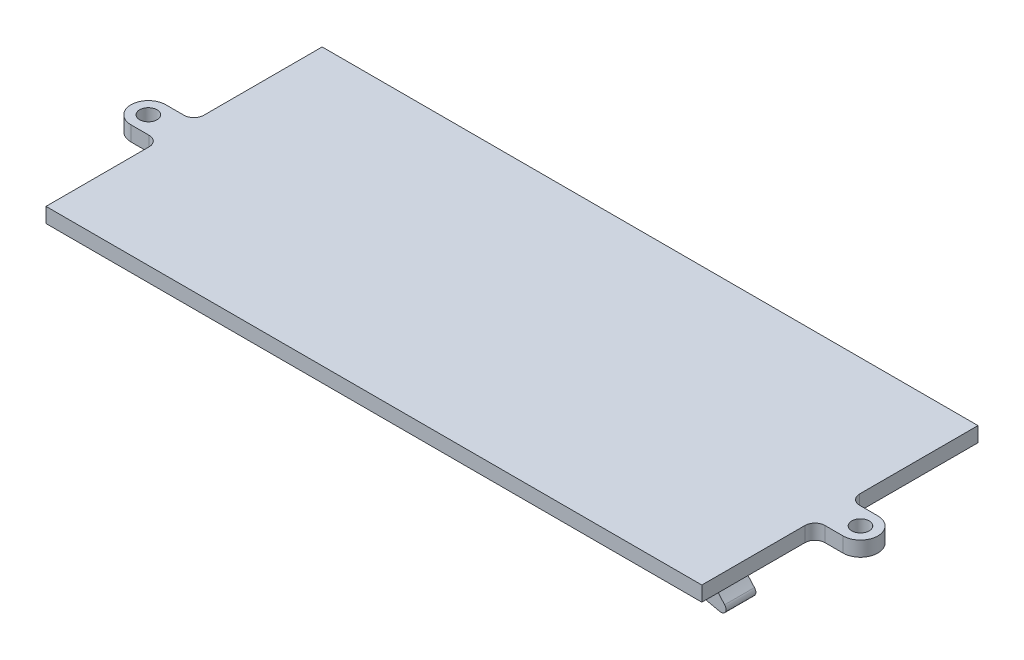
ISO-10303-21;
HEADER;
FILE_DESCRIPTION(('STEP AP214'),'2;1');
FILE_NAME('part.step','',(''),(''),'','','');
FILE_SCHEMA(('AUTOMOTIVE_DESIGN { 1 0 10303 214 1 1 1 1 }'));
ENDSEC;
DATA;
#1=APPLICATION_CONTEXT('core data for automotive mechanical design processes');
#2=APPLICATION_PROTOCOL_DEFINITION('international standard','automotive_design',2000,#1);
#3=PRODUCT_CONTEXT('',#1,'mechanical');
#4=PRODUCT('Part','Part','',(#3));
#5=PRODUCT_RELATED_PRODUCT_CATEGORY('part','',(#4));
#6=PRODUCT_DEFINITION_FORMATION('','',#4);
#7=PRODUCT_DEFINITION_CONTEXT('part definition',#1,'design');
#8=PRODUCT_DEFINITION('design','',#6,#7);
#9=PRODUCT_DEFINITION_SHAPE('','',#8);
#10=(LENGTH_UNIT() NAMED_UNIT(*) SI_UNIT(.MILLI.,.METRE.));
#11=(NAMED_UNIT(*) PLANE_ANGLE_UNIT() SI_UNIT($,.RADIAN.));
#12=(NAMED_UNIT(*) SI_UNIT($,.STERADIAN.) SOLID_ANGLE_UNIT());
#13=UNCERTAINTY_MEASURE_WITH_UNIT(LENGTH_MEASURE(1.E-05),#10,'distance_accuracy_value','');
#14=(GEOMETRIC_REPRESENTATION_CONTEXT(3) GLOBAL_UNCERTAINTY_ASSIGNED_CONTEXT((#13)) GLOBAL_UNIT_ASSIGNED_CONTEXT((#10,
#11,#12)) REPRESENTATION_CONTEXT('',''));
#15=CARTESIAN_POINT('',(0.,0.,0.));
#16=DIRECTION('',(0.,0.,1.));
#17=DIRECTION('',(1.,0.,0.));
#18=AXIS2_PLACEMENT_3D('',#15,#16,#17);
#19=CARTESIAN_POINT('',(0.,-74.,0.));
#20=DIRECTION('',(0.,-1.,0.));
#21=DIRECTION('',(1.,0.,0.));
#22=AXIS2_PLACEMENT_3D('',#19,#20,#21);
#23=PLANE('',#22);
#24=DIRECTION('',(1.,0.,0.));
#25=VECTOR('',#24,1.);
#26=CARTESIAN_POINT('',(-39.1631946524163,-74.,-27.5824678281042));
#27=LINE('',#26,#25);
#28=CARTESIAN_POINT('',(-39.1631946524163,-74.,-27.5824678281042));
#29=VERTEX_POINT('',#28);
#30=CARTESIAN_POINT('',(-20.86563649514,-74.,-27.5824678281042));
#31=VERTEX_POINT('',#30);
#32=EDGE_CURVE('E297',#29,#31,#27,.T.);
#33=ORIENTED_EDGE('',*,*,#32,.T.);
#34=DIRECTION('',(0.,0.,-1.));
#35=VECTOR('',#34,1.);
#36=CARTESIAN_POINT('',(-20.86563649514,-74.,-27.5824678281042));
#37=LINE('',#36,#35);
#38=CARTESIAN_POINT('',(-20.86563649514,-74.,-33.5824678281042));
#39=VERTEX_POINT('',#38);
#40=EDGE_CURVE('E302',#31,#39,#37,.T.);
#41=ORIENTED_EDGE('',*,*,#40,.T.);
#42=DIRECTION('',(1.,0.,0.));
#43=VECTOR('',#42,1.);
#44=CARTESIAN_POINT('',(-39.1631946524163,-74.,-33.5824678281042));
#45=LINE('',#44,#43);
#46=CARTESIAN_POINT('',(-39.1631946524163,-74.,-33.5824678281042));
#47=VERTEX_POINT('',#46);
#48=EDGE_CURVE('E287',#47,#39,#45,.T.);
#49=ORIENTED_EDGE('',*,*,#48,.F.);
#50=DIRECTION('',(0.,0.,-1.));
#51=VECTOR('',#50,1.);
#52=CARTESIAN_POINT('',(-39.1631946524163,-74.,-27.5824678281042));
#53=LINE('',#52,#51);
#54=EDGE_CURVE('E301',#29,#47,#53,.T.);
#55=ORIENTED_EDGE('',*,*,#54,.F.);
#56=EDGE_LOOP('',(#33,#41,#49,#55));
#57=FACE_BOUND('',#56,.T.);
#58=DIRECTION('',(0.,0.,-1.));
#59=VECTOR('',#58,1.);
#60=CARTESIAN_POINT('',(-65.9999999999999,-74.,-4.99999999999999));
#61=LINE('',#60,#59);
#62=CARTESIAN_POINT('',(-65.9999999999999,-74.,-4.99999999999999));
#63=VERTEX_POINT('',#62);
#64=CARTESIAN_POINT('',(-65.9999999999999,-74.,-25.7671955427555));
#65=VERTEX_POINT('',#64);
#66=EDGE_CURVE('E440',#63,#65,#61,.T.);
#67=ORIENTED_EDGE('',*,*,#66,.T.);
#68=CARTESIAN_POINT('',(-68.,-74.,-25.7671955427555));
#69=DIRECTION('',(0.,-1.,0.));
#70=DIRECTION('',(1.,0.,0.));
#71=AXIS2_PLACEMENT_3D('',#68,#69,#70);
#72=CIRCLE('',#71,2.);
#73=CARTESIAN_POINT('',(-68.,-74.,-27.7671955427555));
#74=VERTEX_POINT('',#73);
#75=EDGE_CURVE('E357',#74,#65,#72,.T.);
#76=ORIENTED_EDGE('',*,*,#75,.F.);
#77=DIRECTION('',(-1.,0.,0.));
#78=VECTOR('',#77,1.);
#79=CARTESIAN_POINT('',(-1.65634172628686E-13,-74.,-27.7671955427558));
#80=LINE('',#79,#78);
#81=CARTESIAN_POINT('',(-71.6621267420827,-74.,-27.7671955427554));
#82=VERTEX_POINT('',#81);
#83=EDGE_CURVE('E402',#74,#82,#80,.T.);
#84=ORIENTED_EDGE('',*,*,#83,.T.);
#85=CARTESIAN_POINT('',(-71.6621267420827,-74.,-31.2671955427555));
#86=DIRECTION('',(0.,-1.,0.));
#87=DIRECTION('',(1.,0.,0.));
#88=AXIS2_PLACEMENT_3D('',#85,#86,#87);
#89=CIRCLE('',#88,3.50000000000001);
#90=CARTESIAN_POINT('',(-71.6621267420827,-74.,-34.7671955427555));
#91=VERTEX_POINT('',#90);
#92=EDGE_CURVE('E406',#82,#91,#89,.T.);
#93=ORIENTED_EDGE('',*,*,#92,.T.);
#94=DIRECTION('',(1.,0.,0.));
#95=VECTOR('',#94,1.);
#96=CARTESIAN_POINT('',(0.,-74.,-34.7671955427556));
#97=LINE('',#96,#95);
#98=CARTESIAN_POINT('',(-68.0000000000001,-74.,-34.7671955427555));
#99=VERTEX_POINT('',#98);
#100=EDGE_CURVE('E410',#91,#99,#97,.T.);
#101=ORIENTED_EDGE('',*,*,#100,.T.);
#102=CARTESIAN_POINT('',(-68.,-74.,-36.7671955427555));
#103=DIRECTION('',(0.,-1.,0.));
#104=DIRECTION('',(1.,0.,0.));
#105=AXIS2_PLACEMENT_3D('',#102,#103,#104);
#106=CIRCLE('',#105,2.00000000000001);
#107=CARTESIAN_POINT('',(-65.9999999999999,-74.,-36.7671955427555));
#108=VERTEX_POINT('',#107);
#109=EDGE_CURVE('E414',#108,#99,#106,.T.);
#110=ORIENTED_EDGE('',*,*,#109,.F.);
#111=CARTESIAN_POINT('',(-65.9999999999999,-74.,-60.5824678281042));
#112=VERTEX_POINT('',#111);
#113=EDGE_CURVE('E445',#108,#112,#61,.T.);
#114=ORIENTED_EDGE('',*,*,#113,.T.);
#115=DIRECTION('',(1.,0.,0.));
#116=VECTOR('',#115,1.);
#117=CARTESIAN_POINT('',(-65.9999999999999,-74.,-60.5824678281042));
#118=LINE('',#117,#116);
#119=CARTESIAN_POINT('',(66.,-74.0000000000001,-60.5824678281042));
#120=VERTEX_POINT('',#119);
#121=EDGE_CURVE('E444',#112,#120,#118,.T.);
#122=ORIENTED_EDGE('',*,*,#121,.T.);
#123=DIRECTION('',(0.,0.,1.));
#124=VECTOR('',#123,1.);
#125=CARTESIAN_POINT('',(66.,-74.0000000000001,-4.99999999999999));
#126=LINE('',#125,#124);
#127=CARTESIAN_POINT('',(66.,-74.0000000000001,-36.7671955427554));
#128=VERTEX_POINT('',#127);
#129=EDGE_CURVE('E449',#120,#128,#126,.T.);
#130=ORIENTED_EDGE('',*,*,#129,.T.);
#131=CARTESIAN_POINT('',(68.0000000000002,-74.0000000000001,-36.7671955427554));
#132=DIRECTION('',(0.,-1.,0.));
#133=DIRECTION('',(1.,0.,0.));
#134=AXIS2_PLACEMENT_3D('',#131,#132,#133);
#135=CIRCLE('',#134,2.00000000000001);
#136=CARTESIAN_POINT('',(68.0000000000002,-74.0000000000001,-34.7671955427554));
#137=VERTEX_POINT('',#136);
#138=EDGE_CURVE('E336',#128,#137,#135,.F.);
#139=ORIENTED_EDGE('',*,*,#138,.T.);
#140=DIRECTION('',(-1.,0.,0.));
#141=VECTOR('',#140,1.);
#142=CARTESIAN_POINT('',(0.,-74.,-34.7671955427556));
#143=LINE('',#142,#141);
#144=CARTESIAN_POINT('',(71.6621267420828,-74.0000000000001,-34.7671955427554));
#145=VERTEX_POINT('',#144);
#146=EDGE_CURVE('E340',#145,#137,#143,.T.);
#147=ORIENTED_EDGE('',*,*,#146,.F.);
#148=CARTESIAN_POINT('',(71.6621267420827,-74.0000000000001,-31.2671955427554));
#149=DIRECTION('',(0.,-1.,0.));
#150=DIRECTION('',(1.,0.,0.));
#151=AXIS2_PLACEMENT_3D('',#148,#149,#150);
#152=CIRCLE('',#151,3.50000000000001);
#153=CARTESIAN_POINT('',(71.6621267420827,-74.0000000000001,-27.7671955427554));
#154=VERTEX_POINT('',#153);
#155=EDGE_CURVE('E344',#154,#145,#152,.F.);
#156=ORIENTED_EDGE('',*,*,#155,.F.);
#157=DIRECTION('',(1.,0.,0.));
#158=VECTOR('',#157,1.);
#159=CARTESIAN_POINT('',(0.,-74.,-27.7671955427557));
#160=LINE('',#159,#158);
#161=CARTESIAN_POINT('',(68.0000000000001,-74.0000000000001,-27.7671955427554));
#162=VERTEX_POINT('',#161);
#163=EDGE_CURVE('E347',#162,#154,#160,.T.);
#164=ORIENTED_EDGE('',*,*,#163,.F.);
#165=CARTESIAN_POINT('',(68.0000000000001,-74.0000000000001,-25.7671955427554));
#166=DIRECTION('',(0.,-1.,0.));
#167=DIRECTION('',(1.,0.,0.));
#168=AXIS2_PLACEMENT_3D('',#165,#166,#167);
#169=CIRCLE('',#168,2.);
#170=CARTESIAN_POINT('',(66.,-74.0000000000001,-25.7671955427554));
#171=VERTEX_POINT('',#170);
#172=EDGE_CURVE('E315',#162,#171,#169,.F.);
#173=ORIENTED_EDGE('',*,*,#172,.T.);
#174=CARTESIAN_POINT('',(66.,-74.0000000000001,-4.99999999999999));
#175=VERTEX_POINT('',#174);
#176=EDGE_CURVE('E448',#171,#175,#126,.T.);
#177=ORIENTED_EDGE('',*,*,#176,.T.);
#178=DIRECTION('',(-1.,0.,0.));
#179=VECTOR('',#178,1.);
#180=CARTESIAN_POINT('',(-65.9999999999999,-74.,-4.99999999999999));
#181=LINE('',#180,#179);
#182=EDGE_CURVE('E453',#175,#63,#181,.T.);
#183=ORIENTED_EDGE('',*,*,#182,.T.);
#184=EDGE_LOOP('',(#67,#76,#84,#93,#101,#110,#114,#122,#130,#139,#147,#156,#164,#173,#177,#183));
#185=FACE_BOUND('',#184,.T.);
#186=CARTESIAN_POINT('',(-71.6621267420827,-74.,-31.2671955427555));
#187=DIRECTION('',(0.,-1.,0.));
#188=DIRECTION('',(1.,0.,0.));
#189=AXIS2_PLACEMENT_3D('',#186,#187,#188);
#190=CIRCLE('',#189,1.75);
#191=CARTESIAN_POINT('',(-69.9121267420827,-74.,-31.2671955427555));
#192=VERTEX_POINT('',#191);
#193=EDGE_CURVE('E379',#192,#192,#190,.T.);
#194=ORIENTED_EDGE('',*,*,#193,.F.);
#195=EDGE_LOOP('',(#194));
#196=FACE_BOUND('',#195,.T.);
#197=CARTESIAN_POINT('',(71.6621267420827,-74.0000000000001,-31.2671955427554));
#198=DIRECTION('',(0.,-1.,0.));
#199=DIRECTION('',(1.,0.,0.));
#200=AXIS2_PLACEMENT_3D('',#197,#198,#199);
#201=CIRCLE('',#200,1.75);
#202=CARTESIAN_POINT('',(73.4121267420827,-74.0000000000001,-31.2671955427554));
#203=VERTEX_POINT('',#202);
#204=EDGE_CURVE('E306',#203,#203,#201,.F.);
#205=ORIENTED_EDGE('',*,*,#204,.T.);
#206=EDGE_LOOP('',(#205));
#207=FACE_BOUND('',#206,.T.);
#208=DIRECTION('',(0.,0.,-1.));
#209=VECTOR('',#208,1.);
#210=CARTESIAN_POINT('',(20.8656364951401,-74.0000000000001,-27.5824678281042));
#211=LINE('',#210,#209);
#212=CARTESIAN_POINT('',(20.8656364951401,-74.,-27.5824678281042));
#213=VERTEX_POINT('',#212);
#214=CARTESIAN_POINT('',(20.8656364951401,-74.,-33.5824678281042));
#215=VERTEX_POINT('',#214);
#216=EDGE_CURVE('E253',#213,#215,#211,.T.);
#217=ORIENTED_EDGE('',*,*,#216,.F.);
#218=DIRECTION('',(1.,0.,0.));
#219=VECTOR('',#218,1.);
#220=CARTESIAN_POINT('',(39.1631946524164,-74.0000000000002,-27.5824678281042));
#221=LINE('',#220,#219);
#222=CARTESIAN_POINT('',(39.1631946524164,-74.,-27.5824678281042));
#223=VERTEX_POINT('',#222);
#224=EDGE_CURVE('E246',#213,#223,#221,.T.);
#225=ORIENTED_EDGE('',*,*,#224,.T.);
#226=DIRECTION('',(0.,0.,-1.));
#227=VECTOR('',#226,1.);
#228=CARTESIAN_POINT('',(39.1631946524164,-74.0000000000002,-27.5824678281042));
#229=LINE('',#228,#227);
#230=CARTESIAN_POINT('',(39.1631946524164,-74.0000000000002,-33.5824678281042));
#231=VERTEX_POINT('',#230);
#232=EDGE_CURVE('E240',#223,#231,#229,.T.);
#233=ORIENTED_EDGE('',*,*,#232,.T.);
#234=DIRECTION('',(1.,0.,0.));
#235=VECTOR('',#234,1.);
#236=CARTESIAN_POINT('',(39.1631946524164,-74.0000000000002,-33.5824678281042));
#237=LINE('',#236,#235);
#238=EDGE_CURVE('E243',#215,#231,#237,.T.);
#239=ORIENTED_EDGE('',*,*,#238,.F.);
#240=EDGE_LOOP('',(#217,#225,#233,#239));
#241=FACE_BOUND('',#240,.T.);
#242=ADVANCED_FACE('F80',(#57,#185,#196,#207,#241),#23,.T.);
#243=CARTESIAN_POINT('',(66.,-74.0000000000001,-4.99999999999999));
#244=DIRECTION('',(-1.,0.,0.));
#245=DIRECTION('',(0.,-1.,0.));
#246=AXIS2_PLACEMENT_3D('',#243,#244,#245);
#247=PLANE('',#246);
#248=DIRECTION('',(0.,-1.,0.));
#249=VECTOR('',#248,1.);
#250=CARTESIAN_POINT('',(66.,-71.,-36.7671955427554));
#251=LINE('',#250,#249);
#252=CARTESIAN_POINT('',(66.,-71.,-36.7671955427554));
#253=VERTEX_POINT('',#252);
#254=EDGE_CURVE('E332',#253,#128,#251,.T.);
#255=ORIENTED_EDGE('',*,*,#254,.T.);
#256=ORIENTED_EDGE('',*,*,#129,.F.);
#257=DIRECTION('',(0.,1.,0.));
#258=VECTOR('',#257,1.);
#259=CARTESIAN_POINT('',(66.,-74.0000000000001,-60.5824678281042));
#260=LINE('',#259,#258);
#261=CARTESIAN_POINT('',(66.,-71.,-60.5824678281042));
#262=VERTEX_POINT('',#261);
#263=EDGE_CURVE('E477',#120,#262,#260,.T.);
#264=ORIENTED_EDGE('',*,*,#263,.T.);
#265=DIRECTION('',(0.,0.,1.));
#266=VECTOR('',#265,1.);
#267=CARTESIAN_POINT('',(66.,-71.,-4.99999999999999));
#268=LINE('',#267,#266);
#269=EDGE_CURVE('E464',#262,#253,#268,.T.);
#270=ORIENTED_EDGE('',*,*,#269,.T.);
#271=EDGE_LOOP('',(#255,#256,#264,#270));
#272=FACE_BOUND('',#271,.T.);
#273=ADVANCED_FACE('F581',(#272),#247,.F.);
#274=CARTESIAN_POINT('',(-65.9999999999999,-74.,-4.99999999999999));
#275=DIRECTION('',(1.,0.,0.));
#276=DIRECTION('',(0.,1.,0.));
#277=AXIS2_PLACEMENT_3D('',#274,#275,#276);
#278=PLANE('',#277);
#279=DIRECTION('',(0.,-1.,0.));
#280=VECTOR('',#279,1.);
#281=CARTESIAN_POINT('',(-65.9999999999999,-71.,-36.7671955427555));
#282=LINE('',#281,#280);
#283=CARTESIAN_POINT('',(-65.9999999999999,-71.,-36.7671955427555));
#284=VERTEX_POINT('',#283);
#285=EDGE_CURVE('E425',#284,#108,#282,.T.);
#286=ORIENTED_EDGE('',*,*,#285,.F.);
#287=DIRECTION('',(0.,0.,-1.));
#288=VECTOR('',#287,1.);
#289=CARTESIAN_POINT('',(-65.9999999999999,-71.,-4.99999999999999));
#290=LINE('',#289,#288);
#291=CARTESIAN_POINT('',(-65.9999999999999,-71.,-60.5824678281042));
#292=VERTEX_POINT('',#291);
#293=EDGE_CURVE('E424',#284,#292,#290,.T.);
#294=ORIENTED_EDGE('',*,*,#293,.T.);
#295=DIRECTION('',(0.,1.,0.));
#296=VECTOR('',#295,1.);
#297=CARTESIAN_POINT('',(-65.9999999999999,-74.,-60.5824678281042));
#298=LINE('',#297,#296);
#299=EDGE_CURVE('E481',#112,#292,#298,.T.);
#300=ORIENTED_EDGE('',*,*,#299,.F.);
#301=ORIENTED_EDGE('',*,*,#113,.F.);
#302=EDGE_LOOP('',(#286,#294,#300,#301));
#303=FACE_BOUND('',#302,.T.);
#304=ADVANCED_FACE('F510',(#303),#278,.F.);
#305=CARTESIAN_POINT('',(-65.9999999999999,-71.,-4.99999999999999));
#306=VERTEX_POINT('',#305);
#307=CARTESIAN_POINT('',(-65.9999999999999,-71.,-25.7671955427555));
#308=VERTEX_POINT('',#307);
#309=EDGE_CURVE('E457',#306,#308,#290,.T.);
#310=ORIENTED_EDGE('',*,*,#309,.T.);
#311=DIRECTION('',(0.,-1.,0.));
#312=VECTOR('',#311,1.);
#313=CARTESIAN_POINT('',(-65.9999999999999,-71.,-25.7671955427555));
#314=LINE('',#313,#312);
#315=EDGE_CURVE('E421',#308,#65,#314,.T.);
#316=ORIENTED_EDGE('',*,*,#315,.T.);
#317=ORIENTED_EDGE('',*,*,#66,.F.);
#318=DIRECTION('',(0.,1.,0.));
#319=VECTOR('',#318,1.);
#320=CARTESIAN_POINT('',(-65.9999999999999,-74.,-4.99999999999999));
#321=LINE('',#320,#319);
#322=EDGE_CURVE('E456',#63,#306,#321,.T.);
#323=ORIENTED_EDGE('',*,*,#322,.T.);
#324=EDGE_LOOP('',(#310,#316,#317,#323));
#325=FACE_BOUND('',#324,.T.);
#326=ADVANCED_FACE('F549',(#325),#278,.F.);
#327=CARTESIAN_POINT('',(-65.9999999999999,-74.,-60.5824678281042));
#328=DIRECTION('',(0.,0.,1.));
#329=DIRECTION('',(0.,-1.,0.));
#330=AXIS2_PLACEMENT_3D('',#327,#328,#329);
#331=PLANE('',#330);
#332=DIRECTION('',(1.,0.,0.));
#333=VECTOR('',#332,1.);
#334=CARTESIAN_POINT('',(-65.9999999999999,-71.,-60.5824678281042));
#335=LINE('',#334,#333);
#336=EDGE_CURVE('E460',#292,#262,#335,.T.);
#337=ORIENTED_EDGE('',*,*,#336,.T.);
#338=ORIENTED_EDGE('',*,*,#263,.F.);
#339=ORIENTED_EDGE('',*,*,#121,.F.);
#340=ORIENTED_EDGE('',*,*,#299,.T.);
#341=EDGE_LOOP('',(#337,#338,#339,#340));
#342=FACE_BOUND('',#341,.T.);
#343=ADVANCED_FACE('F521',(#342),#331,.F.);
#344=ORIENTED_EDGE('',*,*,#176,.F.);
#345=DIRECTION('',(0.,-1.,0.));
#346=VECTOR('',#345,1.);
#347=CARTESIAN_POINT('',(66.,-71.,-25.7671955427554));
#348=LINE('',#347,#346);
#349=CARTESIAN_POINT('',(66.,-71.,-25.7671955427554));
#350=VERTEX_POINT('',#349);
#351=EDGE_CURVE('E353',#350,#171,#348,.T.);
#352=ORIENTED_EDGE('',*,*,#351,.F.);
#353=CARTESIAN_POINT('',(66.,-71.,-4.99999999999999));
#354=VERTEX_POINT('',#353);
#355=EDGE_CURVE('E463',#350,#354,#268,.T.);
#356=ORIENTED_EDGE('',*,*,#355,.T.);
#357=DIRECTION('',(0.,1.,0.));
#358=VECTOR('',#357,1.);
#359=CARTESIAN_POINT('',(66.,-74.0000000000001,-4.99999999999999));
#360=LINE('',#359,#358);
#361=EDGE_CURVE('E473',#175,#354,#360,.T.);
#362=ORIENTED_EDGE('',*,*,#361,.F.);
#363=EDGE_LOOP('',(#344,#352,#356,#362));
#364=FACE_BOUND('',#363,.T.);
#365=ADVANCED_FACE('F558',(#364),#247,.F.);
#366=CARTESIAN_POINT('',(-65.9999999999999,-74.,-4.99999999999999));
#367=DIRECTION('',(0.,0.,-1.));
#368=DIRECTION('',(0.,1.,0.));
#369=AXIS2_PLACEMENT_3D('',#366,#367,#368);
#370=PLANE('',#369);
#371=DIRECTION('',(-1.,0.,0.));
#372=VECTOR('',#371,1.);
#373=CARTESIAN_POINT('',(-65.9999999999999,-71.,-4.99999999999999));
#374=LINE('',#373,#372);
#375=EDGE_CURVE('E467',#354,#306,#374,.T.);
#376=ORIENTED_EDGE('',*,*,#375,.T.);
#377=ORIENTED_EDGE('',*,*,#322,.F.);
#378=ORIENTED_EDGE('',*,*,#182,.F.);
#379=ORIENTED_EDGE('',*,*,#361,.T.);
#380=EDGE_LOOP('',(#376,#377,#378,#379));
#381=FACE_BOUND('',#380,.T.);
#382=ADVANCED_FACE('F554',(#381),#370,.F.);
#383=CARTESIAN_POINT('',(0.,-71.,0.));
#384=DIRECTION('',(0.,-1.,0.));
#385=DIRECTION('',(1.,0.,0.));
#386=AXIS2_PLACEMENT_3D('',#383,#384,#385);
#387=PLANE('',#386);
#388=ORIENTED_EDGE('',*,*,#309,.F.);
#389=ORIENTED_EDGE('',*,*,#375,.F.);
#390=ORIENTED_EDGE('',*,*,#355,.F.);
#391=CARTESIAN_POINT('',(68.0000000000001,-71.,-25.7671955427554));
#392=DIRECTION('',(0.,-1.,0.));
#393=DIRECTION('',(1.,0.,0.));
#394=AXIS2_PLACEMENT_3D('',#391,#392,#393);
#395=CIRCLE('',#394,2.);
#396=CARTESIAN_POINT('',(68.0000000000001,-71.,-27.7671955427554));
#397=VERTEX_POINT('',#396);
#398=EDGE_CURVE('E328',#397,#350,#395,.F.);
#399=ORIENTED_EDGE('',*,*,#398,.F.);
#400=DIRECTION('',(1.,0.,0.));
#401=VECTOR('',#400,1.);
#402=CARTESIAN_POINT('',(0.,-71.,-27.7671955427557));
#403=LINE('',#402,#401);
#404=CARTESIAN_POINT('',(71.6621267420827,-71.,-27.7671955427554));
#405=VERTEX_POINT('',#404);
#406=EDGE_CURVE('E325',#397,#405,#403,.T.);
#407=ORIENTED_EDGE('',*,*,#406,.T.);
#408=CARTESIAN_POINT('',(71.6621267420827,-71.,-31.2671955427554));
#409=DIRECTION('',(0.,-1.,0.));
#410=DIRECTION('',(1.,0.,0.));
#411=AXIS2_PLACEMENT_3D('',#408,#409,#410);
#412=CIRCLE('',#411,3.50000000000001);
#413=CARTESIAN_POINT('',(71.6621267420828,-71.,-34.7671955427554));
#414=VERTEX_POINT('',#413);
#415=EDGE_CURVE('E322',#405,#414,#412,.F.);
#416=ORIENTED_EDGE('',*,*,#415,.T.);
#417=DIRECTION('',(-1.,0.,0.));
#418=VECTOR('',#417,1.);
#419=CARTESIAN_POINT('',(0.,-71.,-34.7671955427556));
#420=LINE('',#419,#418);
#421=CARTESIAN_POINT('',(68.0000000000002,-71.,-34.7671955427554));
#422=VERTEX_POINT('',#421);
#423=EDGE_CURVE('E319',#414,#422,#420,.T.);
#424=ORIENTED_EDGE('',*,*,#423,.T.);
#425=CARTESIAN_POINT('',(68.0000000000002,-71.,-36.7671955427554));
#426=DIRECTION('',(0.,-1.,0.));
#427=DIRECTION('',(1.,0.,0.));
#428=AXIS2_PLACEMENT_3D('',#425,#426,#427);
#429=CIRCLE('',#428,2.00000000000001);
#430=EDGE_CURVE('E314',#253,#422,#429,.F.);
#431=ORIENTED_EDGE('',*,*,#430,.F.);
#432=ORIENTED_EDGE('',*,*,#269,.F.);
#433=ORIENTED_EDGE('',*,*,#336,.F.);
#434=ORIENTED_EDGE('',*,*,#293,.F.);
#435=CARTESIAN_POINT('',(-68.,-71.,-36.7671955427555));
#436=DIRECTION('',(0.,-1.,0.));
#437=DIRECTION('',(1.,0.,0.));
#438=AXIS2_PLACEMENT_3D('',#435,#436,#437);
#439=CIRCLE('',#438,2.00000000000001);
#440=CARTESIAN_POINT('',(-68.0000000000001,-71.,-34.7671955427555));
#441=VERTEX_POINT('',#440);
#442=EDGE_CURVE('E391',#284,#441,#439,.T.);
#443=ORIENTED_EDGE('',*,*,#442,.T.);
#444=DIRECTION('',(1.,0.,0.));
#445=VECTOR('',#444,1.);
#446=CARTESIAN_POINT('',(0.,-71.,-34.7671955427556));
#447=LINE('',#446,#445);
#448=CARTESIAN_POINT('',(-71.6621267420827,-71.,-34.7671955427555));
#449=VERTEX_POINT('',#448);
#450=EDGE_CURVE('E387',#449,#441,#447,.T.);
#451=ORIENTED_EDGE('',*,*,#450,.F.);
#452=CARTESIAN_POINT('',(-71.6621267420827,-71.,-31.2671955427555));
#453=DIRECTION('',(0.,-1.,0.));
#454=DIRECTION('',(1.,0.,0.));
#455=AXIS2_PLACEMENT_3D('',#452,#453,#454);
#456=CIRCLE('',#455,3.50000000000001);
#457=CARTESIAN_POINT('',(-71.6621267420827,-71.,-27.7671955427554));
#458=VERTEX_POINT('',#457);
#459=EDGE_CURVE('E383',#458,#449,#456,.T.);
#460=ORIENTED_EDGE('',*,*,#459,.F.);
#461=DIRECTION('',(-1.,0.,0.));
#462=VECTOR('',#461,1.);
#463=CARTESIAN_POINT('',(-1.64372555555249E-13,-71.,-27.7671955427558));
#464=LINE('',#463,#462);
#465=CARTESIAN_POINT('',(-68.,-71.,-27.7671955427555));
#466=VERTEX_POINT('',#465);
#467=EDGE_CURVE('E378',#466,#458,#464,.T.);
#468=ORIENTED_EDGE('',*,*,#467,.F.);
#469=CARTESIAN_POINT('',(-68.,-71.,-25.7671955427555));
#470=DIRECTION('',(0.,-1.,0.));
#471=DIRECTION('',(1.,0.,0.));
#472=AXIS2_PLACEMENT_3D('',#469,#470,#471);
#473=CIRCLE('',#472,2.);
#474=EDGE_CURVE('E374',#466,#308,#473,.T.);
#475=ORIENTED_EDGE('',*,*,#474,.T.);
#476=EDGE_LOOP('',(#388,#389,#390,#399,#407,#416,#424,#431,#432,#433,#434,#443,#451,#460,#468,#475));
#477=FACE_BOUND('',#476,.T.);
#478=CARTESIAN_POINT('',(-71.6621267420827,-71.,-31.2671955427555));
#479=DIRECTION('',(0.,-1.,0.));
#480=DIRECTION('',(1.,0.,0.));
#481=AXIS2_PLACEMENT_3D('',#478,#479,#480);
#482=CIRCLE('',#481,1.75);
#483=CARTESIAN_POINT('',(-69.9121267420827,-71.,-31.2671955427555));
#484=VERTEX_POINT('',#483);
#485=EDGE_CURVE('E394',#484,#484,#482,.T.);
#486=ORIENTED_EDGE('',*,*,#485,.T.);
#487=EDGE_LOOP('',(#486));
#488=FACE_BOUND('',#487,.T.);
#489=CARTESIAN_POINT('',(71.6621267420827,-71.,-31.2671955427554));
#490=DIRECTION('',(0.,-1.,0.));
#491=DIRECTION('',(1.,0.,0.));
#492=AXIS2_PLACEMENT_3D('',#489,#490,#491);
#493=CIRCLE('',#492,1.75);
#494=CARTESIAN_POINT('',(73.4121267420827,-71.,-31.2671955427554));
#495=VERTEX_POINT('',#494);
#496=EDGE_CURVE('E310',#495,#495,#493,.F.);
#497=ORIENTED_EDGE('',*,*,#496,.F.);
#498=EDGE_LOOP('',(#497));
#499=FACE_BOUND('',#498,.T.);
#500=ADVANCED_FACE('F515',(#477,#488,#499),#387,.F.);
#501=CARTESIAN_POINT('',(-68.,-71.,-25.7671955427555));
#502=DIRECTION('',(0.,-1.,0.));
#503=DIRECTION('',(1.,0.,0.));
#504=AXIS2_PLACEMENT_3D('',#501,#502,#503);
#505=CYLINDRICAL_SURFACE('',#504,2.);
#506=ORIENTED_EDGE('',*,*,#75,.T.);
#507=ORIENTED_EDGE('',*,*,#315,.F.);
#508=ORIENTED_EDGE('',*,*,#474,.F.);
#509=DIRECTION('',(0.,-1.,0.));
#510=VECTOR('',#509,1.);
#511=CARTESIAN_POINT('',(-68.,-71.,-27.7671955427555));
#512=LINE('',#511,#510);
#513=EDGE_CURVE('E398',#466,#74,#512,.T.);
#514=ORIENTED_EDGE('',*,*,#513,.T.);
#515=EDGE_LOOP('',(#506,#507,#508,#514));
#516=FACE_BOUND('',#515,.T.);
#517=ADVANCED_FACE('F545',(#516),#505,.F.);
#518=CARTESIAN_POINT('',(-68.,-71.,-36.7671955427555));
#519=DIRECTION('',(0.,-1.,0.));
#520=DIRECTION('',(1.,0.,0.));
#521=AXIS2_PLACEMENT_3D('',#518,#519,#520);
#522=CYLINDRICAL_SURFACE('',#521,2.00000000000001);
#523=ORIENTED_EDGE('',*,*,#109,.T.);
#524=DIRECTION('',(0.,-1.,0.));
#525=VECTOR('',#524,1.);
#526=CARTESIAN_POINT('',(-68.0000000000001,-71.,-34.7671955427555));
#527=LINE('',#526,#525);
#528=EDGE_CURVE('E429',#441,#99,#527,.T.);
#529=ORIENTED_EDGE('',*,*,#528,.F.);
#530=ORIENTED_EDGE('',*,*,#442,.F.);
#531=ORIENTED_EDGE('',*,*,#285,.T.);
#532=EDGE_LOOP('',(#523,#529,#530,#531));
#533=FACE_BOUND('',#532,.T.);
#534=ADVANCED_FACE('F528',(#533),#522,.F.);
#535=CARTESIAN_POINT('',(0.,-71.,-34.7671955427556));
#536=DIRECTION('',(0.,0.,-1.));
#537=DIRECTION('',(-1.,0.,0.));
#538=AXIS2_PLACEMENT_3D('',#535,#536,#537);
#539=PLANE('',#538);
#540=ORIENTED_EDGE('',*,*,#100,.F.);
#541=DIRECTION('',(0.,-1.,0.));
#542=VECTOR('',#541,1.);
#543=CARTESIAN_POINT('',(-71.6621267420827,-71.,-34.7671955427555));
#544=LINE('',#543,#542);
#545=EDGE_CURVE('E432',#449,#91,#544,.T.);
#546=ORIENTED_EDGE('',*,*,#545,.F.);
#547=ORIENTED_EDGE('',*,*,#450,.T.);
#548=ORIENTED_EDGE('',*,*,#528,.T.);
#549=EDGE_LOOP('',(#540,#546,#547,#548));
#550=FACE_BOUND('',#549,.T.);
#551=ADVANCED_FACE('F660',(#550),#539,.T.);
#552=CARTESIAN_POINT('',(-71.6621267420827,-71.,-31.2671955427555));
#553=DIRECTION('',(0.,-1.,0.));
#554=DIRECTION('',(1.,0.,0.));
#555=AXIS2_PLACEMENT_3D('',#552,#553,#554);
#556=CYLINDRICAL_SURFACE('',#555,3.50000000000001);
#557=ORIENTED_EDGE('',*,*,#92,.F.);
#558=DIRECTION('',(0.,-1.,0.));
#559=VECTOR('',#558,1.);
#560=CARTESIAN_POINT('',(-71.6621267420827,-71.,-27.7671955427554));
#561=LINE('',#560,#559);
#562=EDGE_CURVE('E435',#458,#82,#561,.T.);
#563=ORIENTED_EDGE('',*,*,#562,.F.);
#564=ORIENTED_EDGE('',*,*,#459,.T.);
#565=ORIENTED_EDGE('',*,*,#545,.T.);
#566=EDGE_LOOP('',(#557,#563,#564,#565));
#567=FACE_BOUND('',#566,.T.);
#568=ADVANCED_FACE('F536',(#567),#556,.T.);
#569=CARTESIAN_POINT('',(-1.64372555555249E-13,-71.,-27.7671955427558));
#570=DIRECTION('',(0.,0.,1.));
#571=DIRECTION('',(1.,0.,0.));
#572=AXIS2_PLACEMENT_3D('',#569,#570,#571);
#573=PLANE('',#572);
#574=ORIENTED_EDGE('',*,*,#83,.F.);
#575=ORIENTED_EDGE('',*,*,#513,.F.);
#576=ORIENTED_EDGE('',*,*,#467,.T.);
#577=ORIENTED_EDGE('',*,*,#562,.T.);
#578=EDGE_LOOP('',(#574,#575,#576,#577));
#579=FACE_BOUND('',#578,.T.);
#580=ADVANCED_FACE('F540',(#579),#573,.T.);
#581=CARTESIAN_POINT('',(-71.6621267420827,-71.,-31.2671955427555));
#582=DIRECTION('',(0.,-1.,0.));
#583=DIRECTION('',(1.,0.,0.));
#584=AXIS2_PLACEMENT_3D('',#581,#582,#583);
#585=CYLINDRICAL_SURFACE('',#584,1.75);
#586=ORIENTED_EDGE('',*,*,#485,.F.);
#587=EDGE_LOOP('',(#586));
#588=FACE_BOUND('',#587,.T.);
#589=ORIENTED_EDGE('',*,*,#193,.T.);
#590=EDGE_LOOP('',(#589));
#591=FACE_BOUND('',#590,.T.);
#592=ADVANCED_FACE('F642',(#588,#591),#585,.F.);
#593=CARTESIAN_POINT('',(68.0000000000001,-71.,-25.7671955427554));
#594=DIRECTION('',(0.,-1.,0.));
#595=DIRECTION('',(1.,0.,0.));
#596=AXIS2_PLACEMENT_3D('',#593,#594,#595);
#597=CYLINDRICAL_SURFACE('',#596,2.);
#598=ORIENTED_EDGE('',*,*,#172,.F.);
#599=DIRECTION('',(0.,-1.,0.));
#600=VECTOR('',#599,1.);
#601=CARTESIAN_POINT('',(68.0000000000001,-71.,-27.7671955427554));
#602=LINE('',#601,#600);
#603=EDGE_CURVE('E358',#397,#162,#602,.T.);
#604=ORIENTED_EDGE('',*,*,#603,.F.);
#605=ORIENTED_EDGE('',*,*,#398,.T.);
#606=ORIENTED_EDGE('',*,*,#351,.T.);
#607=EDGE_LOOP('',(#598,#604,#605,#606));
#608=FACE_BOUND('',#607,.T.);
#609=ADVANCED_FACE('F561',(#608),#597,.F.);
#610=CARTESIAN_POINT('',(0.,-71.,-27.7671955427557));
#611=DIRECTION('',(0.,0.,-1.));
#612=DIRECTION('',(-1.,0.,0.));
#613=AXIS2_PLACEMENT_3D('',#610,#611,#612);
#614=PLANE('',#613);
#615=ORIENTED_EDGE('',*,*,#163,.T.);
#616=DIRECTION('',(0.,-1.,0.));
#617=VECTOR('',#616,1.);
#618=CARTESIAN_POINT('',(71.6621267420827,-71.,-27.7671955427554));
#619=LINE('',#618,#617);
#620=EDGE_CURVE('E361',#405,#154,#619,.T.);
#621=ORIENTED_EDGE('',*,*,#620,.F.);
#622=ORIENTED_EDGE('',*,*,#406,.F.);
#623=ORIENTED_EDGE('',*,*,#603,.T.);
#624=EDGE_LOOP('',(#615,#621,#622,#623));
#625=FACE_BOUND('',#624,.T.);
#626=ADVANCED_FACE('F566',(#625),#614,.F.);
#627=CARTESIAN_POINT('',(71.6621267420827,-71.,-31.2671955427554));
#628=DIRECTION('',(0.,-1.,0.));
#629=DIRECTION('',(1.,0.,0.));
#630=AXIS2_PLACEMENT_3D('',#627,#628,#629);
#631=CYLINDRICAL_SURFACE('',#630,3.50000000000001);
#632=ORIENTED_EDGE('',*,*,#155,.T.);
#633=DIRECTION('',(0.,-1.,0.));
#634=VECTOR('',#633,1.);
#635=CARTESIAN_POINT('',(71.6621267420828,-71.,-34.7671955427554));
#636=LINE('',#635,#634);
#637=EDGE_CURVE('E365',#414,#145,#636,.T.);
#638=ORIENTED_EDGE('',*,*,#637,.F.);
#639=ORIENTED_EDGE('',*,*,#415,.F.);
#640=ORIENTED_EDGE('',*,*,#620,.T.);
#641=EDGE_LOOP('',(#632,#638,#639,#640));
#642=FACE_BOUND('',#641,.T.);
#643=ADVANCED_FACE('F572',(#642),#631,.T.);
#644=CARTESIAN_POINT('',(0.,-71.,-34.7671955427556));
#645=DIRECTION('',(0.,0.,1.));
#646=DIRECTION('',(1.,0.,0.));
#647=AXIS2_PLACEMENT_3D('',#644,#645,#646);
#648=PLANE('',#647);
#649=ORIENTED_EDGE('',*,*,#146,.T.);
#650=DIRECTION('',(0.,-1.,0.));
#651=VECTOR('',#650,1.);
#652=CARTESIAN_POINT('',(68.0000000000002,-71.,-34.7671955427554));
#653=LINE('',#652,#651);
#654=EDGE_CURVE('E369',#422,#137,#653,.T.);
#655=ORIENTED_EDGE('',*,*,#654,.F.);
#656=ORIENTED_EDGE('',*,*,#423,.F.);
#657=ORIENTED_EDGE('',*,*,#637,.T.);
#658=EDGE_LOOP('',(#649,#655,#656,#657));
#659=FACE_BOUND('',#658,.T.);
#660=ADVANCED_FACE('F576',(#659),#648,.F.);
#661=CARTESIAN_POINT('',(71.6621267420827,-71.,-31.2671955427554));
#662=DIRECTION('',(0.,-1.,0.));
#663=DIRECTION('',(1.,0.,0.));
#664=AXIS2_PLACEMENT_3D('',#661,#662,#663);
#665=CYLINDRICAL_SURFACE('',#664,1.75);
#666=ORIENTED_EDGE('',*,*,#496,.T.);
#667=EDGE_LOOP('',(#666));
#668=FACE_BOUND('',#667,.T.);
#669=ORIENTED_EDGE('',*,*,#204,.F.);
#670=EDGE_LOOP('',(#669));
#671=FACE_BOUND('',#670,.T.);
#672=ADVANCED_FACE('F649',(#668,#671),#665,.F.);
#673=CARTESIAN_POINT('',(68.0000000000002,-71.,-36.7671955427554));
#674=DIRECTION('',(0.,-1.,0.));
#675=DIRECTION('',(1.,0.,0.));
#676=AXIS2_PLACEMENT_3D('',#673,#674,#675);
#677=CYLINDRICAL_SURFACE('',#676,2.00000000000001);
#678=ORIENTED_EDGE('',*,*,#138,.F.);
#679=ORIENTED_EDGE('',*,*,#254,.F.);
#680=ORIENTED_EDGE('',*,*,#430,.T.);
#681=ORIENTED_EDGE('',*,*,#654,.T.);
#682=EDGE_LOOP('',(#678,#679,#680,#681));
#683=FACE_BOUND('',#682,.T.);
#684=ADVANCED_FACE('F579',(#683),#677,.F.);
#685=CARTESIAN_POINT('',(-53.0278084843589,-62.905713199362,-27.5824678281042));
#686=DIRECTION('',(0.,0.,-1.));
#687=DIRECTION('',(0.,1.,0.));
#688=AXIS2_PLACEMENT_3D('',#685,#686,#687);
#689=CYLINDRICAL_SURFACE('',#688,34.0218827621122);
#690=CARTESIAN_POINT('',(-53.0278084843589,-62.905713199362,-27.5824678281042));
#691=DIRECTION('',(0.,0.,-1.));
#692=DIRECTION('',(0.,-1.,0.));
#693=AXIS2_PLACEMENT_3D('',#690,#691,#692);
#694=CIRCLE('',#693,34.0218827621122);
#695=CARTESIAN_POINT('',(-47.1157586300314,-96.4099841688795,-27.5824678281042));
#696=VERTEX_POINT('',#695);
#697=EDGE_CURVE('E290',#31,#696,#694,.T.);
#698=ORIENTED_EDGE('',*,*,#697,.T.);
#699=DIRECTION('',(0.,0.,-1.));
#700=VECTOR('',#699,1.);
#701=CARTESIAN_POINT('',(-47.1157586300314,-96.4099841688795,-27.5824678281042));
#702=LINE('',#701,#700);
#703=CARTESIAN_POINT('',(-47.1157586300314,-96.4099841688795,-33.5824678281042));
#704=VERTEX_POINT('',#703);
#705=EDGE_CURVE('E496',#696,#704,#702,.T.);
#706=ORIENTED_EDGE('',*,*,#705,.T.);
#707=CARTESIAN_POINT('',(-53.0278084843589,-62.905713199362,-33.5824678281042));
#708=DIRECTION('',(0.,0.,-1.));
#709=DIRECTION('',(0.,-1.,0.));
#710=AXIS2_PLACEMENT_3D('',#707,#708,#709);
#711=CIRCLE('',#710,34.0218827621122);
#712=EDGE_CURVE('E252',#39,#704,#711,.T.);
#713=ORIENTED_EDGE('',*,*,#712,.F.);
#714=ORIENTED_EDGE('',*,*,#40,.F.);
#715=EDGE_LOOP('',(#698,#706,#713,#714));
#716=FACE_BOUND('',#715,.T.);
#717=ADVANCED_FACE('F636',(#716),#689,.T.);
#718=CARTESIAN_POINT('',(-70.5132158869566,-72.8754942304754,-27.5824678281042));
#719=DIRECTION('',(0.,0.,-1.));
#720=DIRECTION('',(0.,1.,0.));
#721=AXIS2_PLACEMENT_3D('',#718,#719,#720);
#722=CYLINDRICAL_SURFACE('',#721,31.3701824131105);
#723=CARTESIAN_POINT('',(-70.5132158869566,-72.8754942304754,-33.5824678281042));
#724=DIRECTION('',(0.,0.,1.));
#725=DIRECTION('',(0.,-1.,0.));
#726=AXIS2_PLACEMENT_3D('',#723,#724,#725);
#727=CIRCLE('',#726,31.3701824131105);
#728=CARTESIAN_POINT('',(-48.0069712753307,-94.728578637796,-33.5824678281042));
#729=VERTEX_POINT('',#728);
#730=EDGE_CURVE('E284',#729,#47,#727,.T.);
#731=ORIENTED_EDGE('',*,*,#730,.F.);
#732=DIRECTION('',(0.,0.,-1.));
#733=VECTOR('',#732,1.);
#734=CARTESIAN_POINT('',(-48.0069712753307,-94.728578637796,-27.5824678281042));
#735=LINE('',#734,#733);
#736=CARTESIAN_POINT('',(-48.0069712753307,-94.728578637796,-27.5824678281042));
#737=VERTEX_POINT('',#736);
#738=EDGE_CURVE('E89',#729,#737,#735,.F.);
#739=ORIENTED_EDGE('',*,*,#738,.T.);
#740=CARTESIAN_POINT('',(-70.5132158869566,-72.8754942304754,-27.5824678281042));
#741=DIRECTION('',(0.,0.,1.));
#742=DIRECTION('',(0.,-1.,0.));
#743=AXIS2_PLACEMENT_3D('',#740,#741,#742);
#744=CIRCLE('',#743,31.3701824131105);
#745=EDGE_CURVE('E294',#737,#29,#744,.T.);
#746=ORIENTED_EDGE('',*,*,#745,.T.);
#747=ORIENTED_EDGE('',*,*,#54,.T.);
#748=EDGE_LOOP('',(#731,#739,#746,#747));
#749=FACE_BOUND('',#748,.T.);
#750=ADVANCED_FACE('F632',(#749),#722,.F.);
#751=CARTESIAN_POINT('',(-53.0278084843589,-62.905713199362,-27.5824678281042));
#752=DIRECTION('',(0.,0.,1.));
#753=DIRECTION('',(0.,-1.,0.));
#754=AXIS2_PLACEMENT_3D('',#751,#752,#753);
#755=PLANE('',#754);
#756=ORIENTED_EDGE('',*,*,#745,.F.);
#757=CARTESIAN_POINT('',(-47.2895306077807,-95.4251982531856,-27.5824678281042));
#758=DIRECTION('',(0.,0.,1.));
#759=DIRECTION('',(0.,-1.,0.));
#760=AXIS2_PLACEMENT_3D('',#757,#758,#759);
#761=CIRCLE('',#760,1.);
#762=EDGE_CURVE('E12',#737,#696,#761,.T.);
#763=ORIENTED_EDGE('',*,*,#762,.T.);
#764=ORIENTED_EDGE('',*,*,#697,.F.);
#765=ORIENTED_EDGE('',*,*,#32,.F.);
#766=EDGE_LOOP('',(#756,#763,#764,#765));
#767=FACE_BOUND('',#766,.T.);
#768=ADVANCED_FACE('F629',(#767),#755,.T.);
#769=CARTESIAN_POINT('',(-53.0278084843589,-62.905713199362,-33.5824678281042));
#770=DIRECTION('',(0.,0.,1.));
#771=DIRECTION('',(0.,-1.,0.));
#772=AXIS2_PLACEMENT_3D('',#769,#770,#771);
#773=PLANE('',#772);
#774=ORIENTED_EDGE('',*,*,#712,.T.);
#775=CARTESIAN_POINT('',(-47.2895306077807,-95.4251982531856,-33.5824678281042));
#776=DIRECTION('',(0.,0.,1.));
#777=DIRECTION('',(0.,-1.,0.));
#778=AXIS2_PLACEMENT_3D('',#775,#776,#777);
#779=CIRCLE('',#778,1.);
#780=EDGE_CURVE('E103',#704,#729,#779,.F.);
#781=ORIENTED_EDGE('',*,*,#780,.T.);
#782=ORIENTED_EDGE('',*,*,#730,.T.);
#783=ORIENTED_EDGE('',*,*,#48,.T.);
#784=EDGE_LOOP('',(#774,#781,#782,#783));
#785=FACE_BOUND('',#784,.T.);
#786=ADVANCED_FACE('F624',(#785),#773,.F.);
#787=CARTESIAN_POINT('',(70.5132158869567,-72.8754942304756,-27.5824678281042));
#788=DIRECTION('',(0.,0.,-1.));
#789=DIRECTION('',(0.,1.,0.));
#790=AXIS2_PLACEMENT_3D('',#787,#788,#789);
#791=CYLINDRICAL_SURFACE('',#790,31.3701824131105);
#792=CARTESIAN_POINT('',(70.5132158869567,-72.8754942304756,-27.5824678281042));
#793=DIRECTION('',(0.,0.,1.));
#794=DIRECTION('',(0.,1.,0.));
#795=AXIS2_PLACEMENT_3D('',#792,#793,#794);
#796=CIRCLE('',#795,31.3701824131105);
#797=CARTESIAN_POINT('',(48.0069712753307,-94.7285786377962,-27.5824678281042));
#798=VERTEX_POINT('',#797);
#799=EDGE_CURVE('E262',#223,#798,#796,.T.);
#800=ORIENTED_EDGE('',*,*,#799,.T.);
#801=DIRECTION('',(0.,0.,-1.));
#802=VECTOR('',#801,1.);
#803=CARTESIAN_POINT('',(48.0069712753307,-94.7285786377962,-27.5824678281042));
#804=LINE('',#803,#802);
#805=CARTESIAN_POINT('',(48.0069712753307,-94.7285786377962,-33.5824678281042));
#806=VERTEX_POINT('',#805);
#807=EDGE_CURVE('E267',#798,#806,#804,.T.);
#808=ORIENTED_EDGE('',*,*,#807,.T.);
#809=CARTESIAN_POINT('',(70.5132158869567,-72.8754942304756,-33.5824678281042));
#810=DIRECTION('',(0.,0.,1.));
#811=DIRECTION('',(0.,1.,0.));
#812=AXIS2_PLACEMENT_3D('',#809,#810,#811);
#813=CIRCLE('',#812,31.3701824131105);
#814=EDGE_CURVE('E258',#231,#806,#813,.T.);
#815=ORIENTED_EDGE('',*,*,#814,.F.);
#816=ORIENTED_EDGE('',*,*,#232,.F.);
#817=EDGE_LOOP('',(#800,#808,#815,#816));
#818=FACE_BOUND('',#817,.T.);
#819=ADVANCED_FACE('F265',(#818),#791,.F.);
#820=CARTESIAN_POINT('',(53.027808484359,-62.9057131993622,-27.5824678281042));
#821=DIRECTION('',(0.,0.,-1.));
#822=DIRECTION('',(0.,1.,0.));
#823=AXIS2_PLACEMENT_3D('',#820,#821,#822);
#824=CYLINDRICAL_SURFACE('',#823,34.0218827621122);
#825=CARTESIAN_POINT('',(53.027808484359,-62.9057131993622,-33.5824678281042));
#826=DIRECTION('',(0.,0.,-1.));
#827=DIRECTION('',(0.,1.,0.));
#828=AXIS2_PLACEMENT_3D('',#825,#826,#827);
#829=CIRCLE('',#828,34.0218827621122);
#830=CARTESIAN_POINT('',(47.1157586300314,-96.4099841688797,-33.5824678281042));
#831=VERTEX_POINT('',#830);
#832=EDGE_CURVE('E260',#831,#215,#829,.T.);
#833=ORIENTED_EDGE('',*,*,#832,.F.);
#834=DIRECTION('',(0.,0.,-1.));
#835=VECTOR('',#834,1.);
#836=CARTESIAN_POINT('',(47.1157586300314,-96.4099841688797,-27.5824678281042));
#837=LINE('',#836,#835);
#838=CARTESIAN_POINT('',(47.1157586300314,-96.4099841688797,-27.5824678281042));
#839=VERTEX_POINT('',#838);
#840=EDGE_CURVE('E490',#831,#839,#837,.F.);
#841=ORIENTED_EDGE('',*,*,#840,.T.);
#842=CARTESIAN_POINT('',(53.027808484359,-62.9057131993622,-27.5824678281042));
#843=DIRECTION('',(0.,0.,-1.));
#844=DIRECTION('',(0.,1.,0.));
#845=AXIS2_PLACEMENT_3D('',#842,#843,#844);
#846=CIRCLE('',#845,34.0218827621122);
#847=EDGE_CURVE('E275',#839,#213,#846,.T.);
#848=ORIENTED_EDGE('',*,*,#847,.T.);
#849=ORIENTED_EDGE('',*,*,#216,.T.);
#850=EDGE_LOOP('',(#833,#841,#848,#849));
#851=FACE_BOUND('',#850,.T.);
#852=ADVANCED_FACE('F616',(#851),#824,.T.);
#853=CARTESIAN_POINT('',(70.5132158869567,-72.8754942304756,-27.5824678281042));
#854=DIRECTION('',(0.,0.,-1.));
#855=DIRECTION('',(0.,1.,0.));
#856=AXIS2_PLACEMENT_3D('',#853,#854,#855);
#857=PLANE('',#856);
#858=ORIENTED_EDGE('',*,*,#847,.F.);
#859=CARTESIAN_POINT('',(47.2895306077807,-95.4251982531858,-27.5824678281042));
#860=DIRECTION('',(0.,0.,-1.));
#861=DIRECTION('',(0.,1.,0.));
#862=AXIS2_PLACEMENT_3D('',#859,#860,#861);
#863=CIRCLE('',#862,1.);
#864=EDGE_CURVE('E493',#839,#798,#863,.F.);
#865=ORIENTED_EDGE('',*,*,#864,.T.);
#866=ORIENTED_EDGE('',*,*,#799,.F.);
#867=ORIENTED_EDGE('',*,*,#224,.F.);
#868=EDGE_LOOP('',(#858,#865,#866,#867));
#869=FACE_BOUND('',#868,.T.);
#870=ADVANCED_FACE('F609',(#869),#857,.F.);
#871=CARTESIAN_POINT('',(70.5132158869567,-72.8754942304756,-33.5824678281042));
#872=DIRECTION('',(0.,0.,-1.));
#873=DIRECTION('',(0.,1.,0.));
#874=AXIS2_PLACEMENT_3D('',#871,#872,#873);
#875=PLANE('',#874);
#876=ORIENTED_EDGE('',*,*,#814,.T.);
#877=CARTESIAN_POINT('',(47.2895306077807,-95.4251982531858,-33.5824678281042));
#878=DIRECTION('',(0.,0.,-1.));
#879=DIRECTION('',(0.,1.,0.));
#880=AXIS2_PLACEMENT_3D('',#877,#878,#879);
#881=CIRCLE('',#880,1.);
#882=EDGE_CURVE('E487',#806,#831,#881,.T.);
#883=ORIENTED_EDGE('',*,*,#882,.T.);
#884=ORIENTED_EDGE('',*,*,#832,.T.);
#885=ORIENTED_EDGE('',*,*,#238,.T.);
#886=EDGE_LOOP('',(#876,#883,#884,#885));
#887=FACE_BOUND('',#886,.T.);
#888=ADVANCED_FACE('F257',(#887),#875,.T.);
#889=CARTESIAN_POINT('',(47.2895306077807,-95.4251982531858,-27.5824678281042));
#890=DIRECTION('',(0.,0.,1.));
#891=DIRECTION('',(0.,-1.,0.));
#892=AXIS2_PLACEMENT_3D('',#889,#890,#891);
#893=CYLINDRICAL_SURFACE('',#892,1.);
#894=ORIENTED_EDGE('',*,*,#864,.F.);
#895=ORIENTED_EDGE('',*,*,#840,.F.);
#896=ORIENTED_EDGE('',*,*,#882,.F.);
#897=ORIENTED_EDGE('',*,*,#807,.F.);
#898=EDGE_LOOP('',(#894,#895,#896,#897));
#899=FACE_BOUND('',#898,.T.);
#900=ADVANCED_FACE('F601',(#899),#893,.T.);
#901=CARTESIAN_POINT('',(-47.2895306077807,-95.4251982531856,-27.5824678281042));
#902=DIRECTION('',(0.,0.,1.));
#903=DIRECTION('',(0.,-1.,0.));
#904=AXIS2_PLACEMENT_3D('',#901,#902,#903);
#905=CYLINDRICAL_SURFACE('',#904,1.);
#906=ORIENTED_EDGE('',*,*,#762,.F.);
#907=ORIENTED_EDGE('',*,*,#738,.F.);
#908=ORIENTED_EDGE('',*,*,#780,.F.);
#909=ORIENTED_EDGE('',*,*,#705,.F.);
#910=EDGE_LOOP('',(#906,#907,#908,#909));
#911=FACE_BOUND('',#910,.T.);
#912=ADVANCED_FACE('F82',(#911),#905,.T.);
#913=CLOSED_SHELL('',(#242,#273,#304,#326,#343,#365,#382,#500,#517,#534,#551,#568,#580,#592,
#609,#626,#643,#660,#672,#684,#717,#750,#768,#786,#819,#852,#870,#888,#900,#912));
#914=MANIFOLD_SOLID_BREP('B2',#913);
#915=ADVANCED_BREP_SHAPE_REPRESENTATION('',(#18,#914),#14);
#916=SHAPE_DEFINITION_REPRESENTATION(#9,#915);
ENDSEC;
END-ISO-10303-21;
